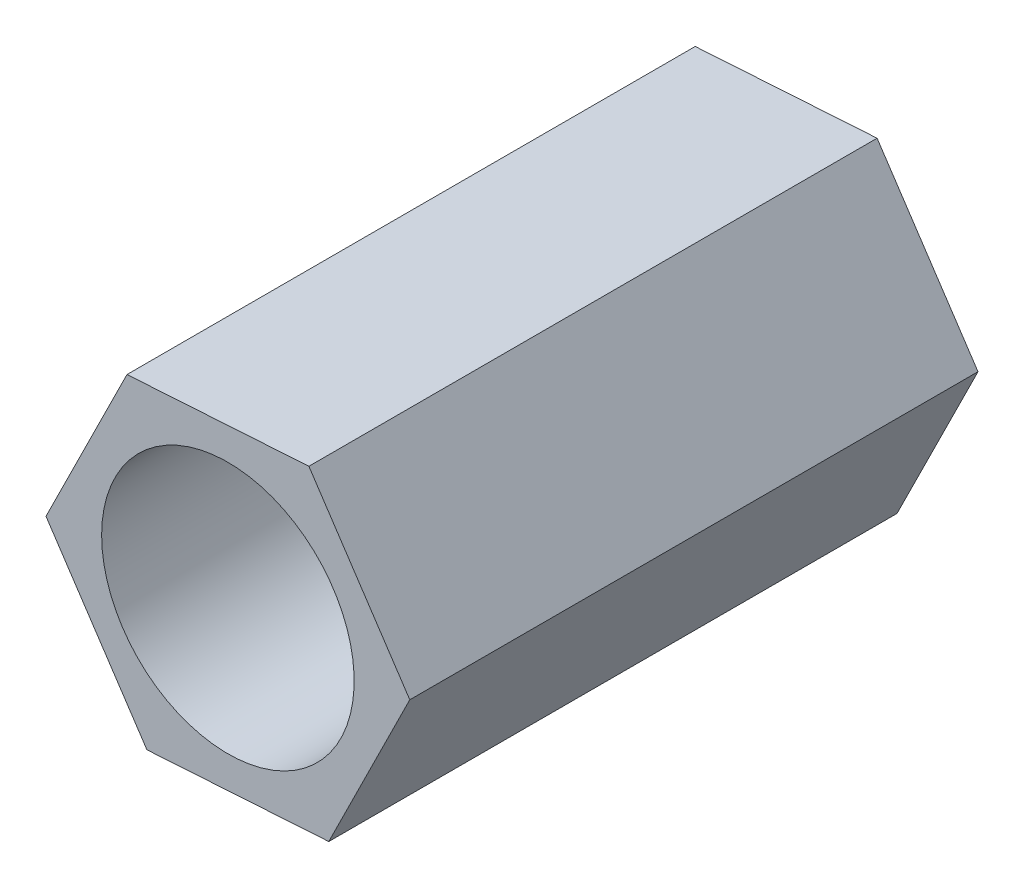
ISO-10303-21;
HEADER;
FILE_DESCRIPTION(('STEP AP214'),'2;1');
FILE_NAME('part.step','',(''),(''),'','','');
FILE_SCHEMA(('AUTOMOTIVE_DESIGN { 1 0 10303 214 1 1 1 1 }'));
ENDSEC;
DATA;
#1=APPLICATION_CONTEXT('core data for automotive mechanical design processes');
#2=APPLICATION_PROTOCOL_DEFINITION('international standard','automotive_design',2000,#1);
#3=PRODUCT_CONTEXT('',#1,'mechanical');
#4=PRODUCT('Part','Part','',(#3));
#5=PRODUCT_RELATED_PRODUCT_CATEGORY('part','',(#4));
#6=PRODUCT_DEFINITION_FORMATION('','',#4);
#7=PRODUCT_DEFINITION_CONTEXT('part definition',#1,'design');
#8=PRODUCT_DEFINITION('design','',#6,#7);
#9=PRODUCT_DEFINITION_SHAPE('','',#8);
#10=(LENGTH_UNIT() NAMED_UNIT(*) SI_UNIT(.MILLI.,.METRE.));
#11=(NAMED_UNIT(*) PLANE_ANGLE_UNIT() SI_UNIT($,.RADIAN.));
#12=(NAMED_UNIT(*) SI_UNIT($,.STERADIAN.) SOLID_ANGLE_UNIT());
#13=UNCERTAINTY_MEASURE_WITH_UNIT(LENGTH_MEASURE(1.E-05),#10,'distance_accuracy_value','');
#14=(GEOMETRIC_REPRESENTATION_CONTEXT(3) GLOBAL_UNCERTAINTY_ASSIGNED_CONTEXT((#13)) GLOBAL_UNIT_ASSIGNED_CONTEXT((#10,
#11,#12)) REPRESENTATION_CONTEXT('',''));
#15=CARTESIAN_POINT('',(0.,0.,0.));
#16=DIRECTION('',(0.,0.,1.));
#17=DIRECTION('',(1.,0.,0.));
#18=AXIS2_PLACEMENT_3D('',#15,#16,#17);
#19=CARTESIAN_POINT('',(2.88100525038189,0.182049665216225,9.));
#20=DIRECTION('',(-0.832769648149025,-0.55361964661828,0.));
#21=DIRECTION('',(0.55361964661828,-0.832769648149025,0.));
#22=AXIS2_PLACEMENT_3D('',#19,#20,#21);
#23=PLANE('',#22);
#24=DIRECTION('',(-0.55361964661828,0.832769648149025,0.));
#25=VECTOR('',#24,1.);
#26=CARTESIAN_POINT('',(2.88100525038189,0.182049665216225,0.));
#27=LINE('',#26,#25);
#28=CARTESIAN_POINT('',(2.88100525038189,0.182049665216225,0.));
#29=VERTEX_POINT('',#28);
#30=CARTESIAN_POINT('',(1.28284299036324,2.58604856787517,0.));
#31=VERTEX_POINT('',#30);
#32=EDGE_CURVE('E128',#29,#31,#27,.T.);
#33=ORIENTED_EDGE('',*,*,#32,.T.);
#34=DIRECTION('',(0.,0.,-1.));
#35=VECTOR('',#34,1.);
#36=CARTESIAN_POINT('',(1.28284299036324,2.58604856787517,9.));
#37=LINE('',#36,#35);
#38=CARTESIAN_POINT('',(1.28284299036324,2.58604856787517,9.));
#39=VERTEX_POINT('',#38);
#40=EDGE_CURVE('E11',#39,#31,#37,.T.);
#41=ORIENTED_EDGE('',*,*,#40,.F.);
#42=DIRECTION('',(-0.55361964661828,0.832769648149025,0.));
#43=VECTOR('',#42,1.);
#44=CARTESIAN_POINT('',(2.88100525038189,0.182049665216225,9.));
#45=LINE('',#44,#43);
#46=CARTESIAN_POINT('',(2.88100525038189,0.182049665216225,9.));
#47=VERTEX_POINT('',#46);
#48=EDGE_CURVE('E145',#47,#39,#45,.T.);
#49=ORIENTED_EDGE('',*,*,#48,.F.);
#50=DIRECTION('',(0.,0.,-1.));
#51=VECTOR('',#50,1.);
#52=CARTESIAN_POINT('',(2.88100525038189,0.182049665216225,9.));
#53=LINE('',#52,#51);
#54=EDGE_CURVE('E124',#47,#29,#53,.T.);
#55=ORIENTED_EDGE('',*,*,#54,.T.);
#56=EDGE_LOOP('',(#33,#41,#49,#55));
#57=FACE_BOUND('',#56,.T.);
#58=ADVANCED_FACE('F39',(#57),#23,.F.);
#59=CARTESIAN_POINT('',(1.28284299036324,2.58604856787517,9.));
#60=DIRECTION('',(0.0630638539310811,-0.998009494106824,0.));
#61=DIRECTION('',(0.998009494106824,0.0630638539310811,0.));
#62=AXIS2_PLACEMENT_3D('',#59,#60,#61);
#63=PLANE('',#62);
#64=DIRECTION('',(-0.998009494106824,-0.0630638539310811,0.));
#65=VECTOR('',#64,1.);
#66=CARTESIAN_POINT('',(1.28284299036324,2.58604856787517,0.));
#67=LINE('',#66,#65);
#68=CARTESIAN_POINT('',(-1.59816226001865,2.40399890265895,0.));
#69=VERTEX_POINT('',#68);
#70=EDGE_CURVE('E132',#31,#69,#67,.T.);
#71=ORIENTED_EDGE('',*,*,#70,.T.);
#72=DIRECTION('',(0.,0.,-1.));
#73=VECTOR('',#72,1.);
#74=CARTESIAN_POINT('',(-1.59816226001865,2.40399890265895,9.));
#75=LINE('',#74,#73);
#76=CARTESIAN_POINT('',(-1.59816226001865,2.40399890265895,9.));
#77=VERTEX_POINT('',#76);
#78=EDGE_CURVE('E48',#77,#69,#75,.T.);
#79=ORIENTED_EDGE('',*,*,#78,.F.);
#80=DIRECTION('',(-0.998009494106824,-0.0630638539310811,0.));
#81=VECTOR('',#80,1.);
#82=CARTESIAN_POINT('',(1.28284299036324,2.58604856787517,9.));
#83=LINE('',#82,#81);
#84=EDGE_CURVE('E93',#39,#77,#83,.T.);
#85=ORIENTED_EDGE('',*,*,#84,.F.);
#86=ORIENTED_EDGE('',*,*,#40,.T.);
#87=EDGE_LOOP('',(#71,#79,#85,#86));
#88=FACE_BOUND('',#87,.T.);
#89=ADVANCED_FACE('F174',(#88),#63,.F.);
#90=CARTESIAN_POINT('',(-1.59816226001865,2.40399890265895,9.));
#91=DIRECTION('',(0.895833502080106,-0.444389847488544,0.));
#92=DIRECTION('',(0.444389847488545,0.895833502080107,0.));
#93=AXIS2_PLACEMENT_3D('',#90,#91,#92);
#94=PLANE('',#93);
#95=DIRECTION('',(-0.444389847488544,-0.895833502080107,0.));
#96=VECTOR('',#95,1.);
#97=CARTESIAN_POINT('',(-1.59816226001865,2.40399890265895,0.));
#98=LINE('',#97,#96);
#99=CARTESIAN_POINT('',(-2.88100525038189,-0.182049665216226,0.));
#100=VERTEX_POINT('',#99);
#101=EDGE_CURVE('E136',#69,#100,#98,.T.);
#102=ORIENTED_EDGE('',*,*,#101,.T.);
#103=DIRECTION('',(0.,0.,-1.));
#104=VECTOR('',#103,1.);
#105=CARTESIAN_POINT('',(-2.88100525038189,-0.182049665216226,9.));
#106=LINE('',#105,#104);
#107=CARTESIAN_POINT('',(-2.88100525038189,-0.182049665216226,9.));
#108=VERTEX_POINT('',#107);
#109=EDGE_CURVE('E117',#108,#100,#106,.T.);
#110=ORIENTED_EDGE('',*,*,#109,.F.);
#111=DIRECTION('',(-0.444389847488544,-0.895833502080107,0.));
#112=VECTOR('',#111,1.);
#113=CARTESIAN_POINT('',(-1.59816226001865,2.40399890265895,9.));
#114=LINE('',#113,#112);
#115=EDGE_CURVE('E106',#77,#108,#114,.T.);
#116=ORIENTED_EDGE('',*,*,#115,.F.);
#117=ORIENTED_EDGE('',*,*,#78,.T.);
#118=EDGE_LOOP('',(#102,#110,#116,#117));
#119=FACE_BOUND('',#118,.T.);
#120=ADVANCED_FACE('F155',(#119),#94,.F.);
#121=CARTESIAN_POINT('',(-2.88100525038189,-0.182049665216226,9.));
#122=DIRECTION('',(0.832769648149025,0.55361964661828,0.));
#123=DIRECTION('',(-0.55361964661828,0.832769648149025,0.));
#124=AXIS2_PLACEMENT_3D('',#121,#122,#123);
#125=PLANE('',#124);
#126=DIRECTION('',(0.55361964661828,-0.832769648149025,0.));
#127=VECTOR('',#126,1.);
#128=CARTESIAN_POINT('',(-2.88100525038189,-0.182049665216226,0.));
#129=LINE('',#128,#127);
#130=CARTESIAN_POINT('',(-1.28284299036324,-2.58604856787517,0.));
#131=VERTEX_POINT('',#130);
#132=EDGE_CURVE('E115',#100,#131,#129,.T.);
#133=ORIENTED_EDGE('',*,*,#132,.T.);
#134=DIRECTION('',(0.,0.,-1.));
#135=VECTOR('',#134,1.);
#136=CARTESIAN_POINT('',(-1.28284299036324,-2.58604856787517,9.));
#137=LINE('',#136,#135);
#138=CARTESIAN_POINT('',(-1.28284299036324,-2.58604856787517,9.));
#139=VERTEX_POINT('',#138);
#140=EDGE_CURVE('E112',#139,#131,#137,.T.);
#141=ORIENTED_EDGE('',*,*,#140,.F.);
#142=DIRECTION('',(0.55361964661828,-0.832769648149025,0.));
#143=VECTOR('',#142,1.);
#144=CARTESIAN_POINT('',(-2.88100525038189,-0.182049665216226,9.));
#145=LINE('',#144,#143);
#146=EDGE_CURVE('E100',#108,#139,#145,.T.);
#147=ORIENTED_EDGE('',*,*,#146,.F.);
#148=ORIENTED_EDGE('',*,*,#109,.T.);
#149=EDGE_LOOP('',(#133,#141,#147,#148));
#150=FACE_BOUND('',#149,.T.);
#151=ADVANCED_FACE('F113',(#150),#125,.F.);
#152=CARTESIAN_POINT('',(-1.28284299036324,-2.58604856787517,9.));
#153=DIRECTION('',(-0.0630638539310813,0.998009494106824,0.));
#154=DIRECTION('',(-0.998009494106824,-0.0630638539310813,0.));
#155=AXIS2_PLACEMENT_3D('',#152,#153,#154);
#156=PLANE('',#155);
#157=DIRECTION('',(0.998009494106824,0.0630638539310813,0.));
#158=VECTOR('',#157,1.);
#159=CARTESIAN_POINT('',(-1.28284299036324,-2.58604856787517,0.));
#160=LINE('',#159,#158);
#161=CARTESIAN_POINT('',(1.59816226001865,-2.40399890265895,0.));
#162=VERTEX_POINT('',#161);
#163=EDGE_CURVE('E79',#131,#162,#160,.T.);
#164=ORIENTED_EDGE('',*,*,#163,.T.);
#165=DIRECTION('',(0.,0.,-1.));
#166=VECTOR('',#165,1.);
#167=CARTESIAN_POINT('',(1.59816226001865,-2.40399890265895,9.));
#168=LINE('',#167,#166);
#169=CARTESIAN_POINT('',(1.59816226001865,-2.40399890265895,9.));
#170=VERTEX_POINT('',#169);
#171=EDGE_CURVE('E118',#170,#162,#168,.T.);
#172=ORIENTED_EDGE('',*,*,#171,.F.);
#173=DIRECTION('',(0.998009494106824,0.0630638539310813,0.));
#174=VECTOR('',#173,1.);
#175=CARTESIAN_POINT('',(-1.28284299036324,-2.58604856787517,9.));
#176=LINE('',#175,#174);
#177=EDGE_CURVE('E104',#139,#170,#176,.T.);
#178=ORIENTED_EDGE('',*,*,#177,.F.);
#179=ORIENTED_EDGE('',*,*,#140,.T.);
#180=EDGE_LOOP('',(#164,#172,#178,#179));
#181=FACE_BOUND('',#180,.T.);
#182=ADVANCED_FACE('F120',(#181),#156,.F.);
#183=CARTESIAN_POINT('',(1.59816226001865,-2.40399890265895,9.));
#184=DIRECTION('',(-0.895833502080106,0.444389847488544,0.));
#185=DIRECTION('',(-0.444389847488545,-0.895833502080107,0.));
#186=AXIS2_PLACEMENT_3D('',#183,#184,#185);
#187=PLANE('',#186);
#188=DIRECTION('',(0.444389847488544,0.895833502080106,0.));
#189=VECTOR('',#188,1.);
#190=CARTESIAN_POINT('',(1.59816226001865,-2.40399890265895,0.));
#191=LINE('',#190,#189);
#192=EDGE_CURVE('E85',#162,#29,#191,.T.);
#193=ORIENTED_EDGE('',*,*,#192,.T.);
#194=ORIENTED_EDGE('',*,*,#54,.F.);
#195=DIRECTION('',(0.444389847488544,0.895833502080106,0.));
#196=VECTOR('',#195,1.);
#197=CARTESIAN_POINT('',(1.59816226001865,-2.40399890265895,9.));
#198=LINE('',#197,#196);
#199=EDGE_CURVE('E56',#170,#47,#198,.T.);
#200=ORIENTED_EDGE('',*,*,#199,.F.);
#201=ORIENTED_EDGE('',*,*,#171,.T.);
#202=EDGE_LOOP('',(#193,#194,#200,#201));
#203=FACE_BOUND('',#202,.T.);
#204=ADVANCED_FACE('F162',(#203),#187,.F.);
#205=CARTESIAN_POINT('',(0.,0.,9.));
#206=DIRECTION('',(0.,0.,1.));
#207=DIRECTION('',(1.,0.,0.));
#208=AXIS2_PLACEMENT_3D('',#205,#206,#207);
#209=PLANE('',#208);
#210=CARTESIAN_POINT('',(0.,0.,9.));
#211=DIRECTION('',(0.,0.,-1.));
#212=DIRECTION('',(-1.,0.,0.));
#213=AXIS2_PLACEMENT_3D('',#210,#211,#212);
#214=CIRCLE('',#213,2.);
#215=CARTESIAN_POINT('',(-2.,0.,9.));
#216=VERTEX_POINT('',#215);
#217=EDGE_CURVE('E133',#216,#216,#214,.T.);
#218=ORIENTED_EDGE('',*,*,#217,.T.);
#219=EDGE_LOOP('',(#218));
#220=FACE_BOUND('',#219,.T.);
#221=ORIENTED_EDGE('',*,*,#48,.T.);
#222=ORIENTED_EDGE('',*,*,#84,.T.);
#223=ORIENTED_EDGE('',*,*,#115,.T.);
#224=ORIENTED_EDGE('',*,*,#146,.T.);
#225=ORIENTED_EDGE('',*,*,#177,.T.);
#226=ORIENTED_EDGE('',*,*,#199,.T.);
#227=EDGE_LOOP('',(#221,#222,#223,#224,#225,#226));
#228=FACE_BOUND('',#227,.T.);
#229=ADVANCED_FACE('F102',(#220,#228),#209,.T.);
#230=CARTESIAN_POINT('',(0.,0.,0.));
#231=DIRECTION('',(0.,0.,1.));
#232=DIRECTION('',(1.,0.,0.));
#233=AXIS2_PLACEMENT_3D('',#230,#231,#232);
#234=PLANE('',#233);
#235=CARTESIAN_POINT('',(0.,0.,0.));
#236=DIRECTION('',(0.,0.,-1.));
#237=DIRECTION('',(-1.,0.,0.));
#238=AXIS2_PLACEMENT_3D('',#235,#236,#237);
#239=CIRCLE('',#238,2.);
#240=CARTESIAN_POINT('',(-2.,0.,0.));
#241=VERTEX_POINT('',#240);
#242=EDGE_CURVE('E229',#241,#241,#239,.T.);
#243=ORIENTED_EDGE('',*,*,#242,.F.);
#244=EDGE_LOOP('',(#243));
#245=FACE_BOUND('',#244,.T.);
#246=ORIENTED_EDGE('',*,*,#32,.F.);
#247=ORIENTED_EDGE('',*,*,#192,.F.);
#248=ORIENTED_EDGE('',*,*,#163,.F.);
#249=ORIENTED_EDGE('',*,*,#132,.F.);
#250=ORIENTED_EDGE('',*,*,#101,.F.);
#251=ORIENTED_EDGE('',*,*,#70,.F.);
#252=EDGE_LOOP('',(#246,#247,#248,#249,#250,#251));
#253=FACE_BOUND('',#252,.T.);
#254=ADVANCED_FACE('F158',(#245,#253),#234,.F.);
#255=CARTESIAN_POINT('',(0.,0.,9.));
#256=DIRECTION('',(0.,0.,-1.));
#257=DIRECTION('',(-1.,0.,0.));
#258=AXIS2_PLACEMENT_3D('',#255,#256,#257);
#259=CYLINDRICAL_SURFACE('',#258,2.);
#260=ORIENTED_EDGE('',*,*,#217,.F.);
#261=EDGE_LOOP('',(#260));
#262=FACE_BOUND('',#261,.T.);
#263=ORIENTED_EDGE('',*,*,#242,.T.);
#264=EDGE_LOOP('',(#263));
#265=FACE_BOUND('',#264,.T.);
#266=ADVANCED_FACE('F211',(#262,#265),#259,.F.);
#267=CLOSED_SHELL('',(#58,#89,#120,#151,#182,#204,#229,#254,#266));
#268=MANIFOLD_SOLID_BREP('B2',#267);
#269=ADVANCED_BREP_SHAPE_REPRESENTATION('',(#18,#268),#14);
#270=SHAPE_DEFINITION_REPRESENTATION(#9,#269);
ENDSEC;
END-ISO-10303-21;
